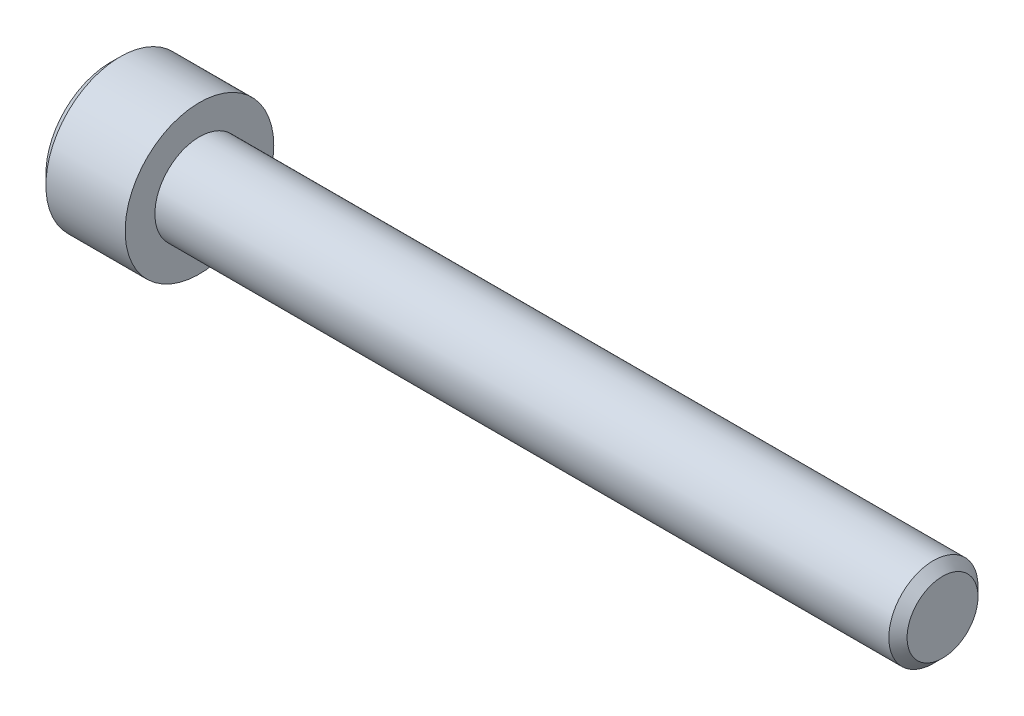
ISO-10303-21;
HEADER;
FILE_DESCRIPTION(('STEP AP214'),'2;1');
FILE_NAME('part.step','',(''),(''),'','','');
FILE_SCHEMA(('AUTOMOTIVE_DESIGN { 1 0 10303 214 1 1 1 1 }'));
ENDSEC;
DATA;
#1=APPLICATION_CONTEXT('core data for automotive mechanical design processes');
#2=APPLICATION_PROTOCOL_DEFINITION('international standard','automotive_design',2000,#1);
#3=PRODUCT_CONTEXT('',#1,'mechanical');
#4=PRODUCT('Part','Part','',(#3));
#5=PRODUCT_RELATED_PRODUCT_CATEGORY('part','',(#4));
#6=PRODUCT_DEFINITION_FORMATION('','',#4);
#7=PRODUCT_DEFINITION_CONTEXT('part definition',#1,'design');
#8=PRODUCT_DEFINITION('design','',#6,#7);
#9=PRODUCT_DEFINITION_SHAPE('','',#8);
#10=(LENGTH_UNIT() NAMED_UNIT(*) SI_UNIT(.MILLI.,.METRE.));
#11=(NAMED_UNIT(*) PLANE_ANGLE_UNIT() SI_UNIT($,.RADIAN.));
#12=(NAMED_UNIT(*) SI_UNIT($,.STERADIAN.) SOLID_ANGLE_UNIT());
#13=UNCERTAINTY_MEASURE_WITH_UNIT(LENGTH_MEASURE(1.E-05),#10,'distance_accuracy_value','');
#14=(GEOMETRIC_REPRESENTATION_CONTEXT(3) GLOBAL_UNCERTAINTY_ASSIGNED_CONTEXT((#13)) GLOBAL_UNIT_ASSIGNED_CONTEXT((#10,
#11,#12)) REPRESENTATION_CONTEXT('',''));
#15=CARTESIAN_POINT('',(0.,0.,0.));
#16=DIRECTION('',(0.,0.,1.));
#17=DIRECTION('',(1.,0.,0.));
#18=AXIS2_PLACEMENT_3D('',#15,#16,#17);
#19=CARTESIAN_POINT('',(-3.,0.,0.));
#20=DIRECTION('',(-1.,0.,0.));
#21=DIRECTION('',(0.,0.,1.));
#22=AXIS2_PLACEMENT_3D('',#19,#20,#21);
#23=CONICAL_SURFACE('',#22,2.5,1.30899693899575);
#24=CARTESIAN_POINT('',(-3.,0.,0.));
#25=DIRECTION('',(1.,0.,0.));
#26=DIRECTION('',(0.,0.,-1.));
#27=AXIS2_PLACEMENT_3D('',#24,#25,#26);
#28=CIRCLE('',#27,2.5);
#29=CARTESIAN_POINT('',(-3.,2.1650635094611,-1.25));
#30=VERTEX_POINT('',#29);
#31=CARTESIAN_POINT('',(-3.,2.1650635094611,1.25));
#32=VERTEX_POINT('',#31);
#33=EDGE_CURVE('E92',#30,#32,#28,.T.);
#34=ORIENTED_EDGE('',*,*,#33,.F.);
#35=CARTESIAN_POINT('',(-3.,0.,0.));
#36=DIRECTION('',(1.,0.,0.));
#37=DIRECTION('',(0.,0.,-1.));
#38=AXIS2_PLACEMENT_3D('',#35,#36,#37);
#39=CIRCLE('',#38,2.5);
#40=CARTESIAN_POINT('',(-3.,0.,-2.5));
#41=VERTEX_POINT('',#40);
#42=EDGE_CURVE('E95',#41,#30,#39,.T.);
#43=ORIENTED_EDGE('',*,*,#42,.F.);
#44=CARTESIAN_POINT('',(-3.,0.,0.));
#45=DIRECTION('',(1.,0.,0.));
#46=DIRECTION('',(0.,0.,-1.));
#47=AXIS2_PLACEMENT_3D('',#44,#45,#46);
#48=CIRCLE('',#47,2.5);
#49=CARTESIAN_POINT('',(-3.,-2.1650635094611,-1.25));
#50=VERTEX_POINT('',#49);
#51=EDGE_CURVE('E10',#50,#41,#48,.T.);
#52=ORIENTED_EDGE('',*,*,#51,.F.);
#53=CARTESIAN_POINT('',(-3.,0.,0.));
#54=DIRECTION('',(1.,0.,0.));
#55=DIRECTION('',(0.,0.,-1.));
#56=AXIS2_PLACEMENT_3D('',#53,#54,#55);
#57=CIRCLE('',#56,2.5);
#58=CARTESIAN_POINT('',(-3.,-2.1650635094611,1.25));
#59=VERTEX_POINT('',#58);
#60=EDGE_CURVE('E25',#59,#50,#57,.T.);
#61=ORIENTED_EDGE('',*,*,#60,.F.);
#62=CARTESIAN_POINT('',(-3.,0.,0.));
#63=DIRECTION('',(1.,0.,0.));
#64=DIRECTION('',(0.,0.,-1.));
#65=AXIS2_PLACEMENT_3D('',#62,#63,#64);
#66=CIRCLE('',#65,2.5);
#67=CARTESIAN_POINT('',(-3.,0.,2.5));
#68=VERTEX_POINT('',#67);
#69=EDGE_CURVE('E141',#68,#59,#66,.T.);
#70=ORIENTED_EDGE('',*,*,#69,.F.);
#71=CARTESIAN_POINT('',(-3.,0.,0.));
#72=DIRECTION('',(1.,0.,0.));
#73=DIRECTION('',(0.,0.,-1.));
#74=AXIS2_PLACEMENT_3D('',#71,#72,#73);
#75=CIRCLE('',#74,2.5);
#76=EDGE_CURVE('E38',#32,#68,#75,.T.);
#77=ORIENTED_EDGE('',*,*,#76,.F.);
#78=EDGE_LOOP('',(#34,#43,#52,#61,#70,#77));
#79=FACE_BOUND('',#78,.T.);
#80=CARTESIAN_POINT('',(-2.33012701892219,0.,0.));
#81=VERTEX_POINT('',#80);
#82=VERTEX_LOOP('',#81);
#83=FACE_BOUND('',#82,.T.);
#84=ADVANCED_FACE('F16',(#79,#83),#23,.F.);
#85=CARTESIAN_POINT('',(-3.,0.,0.));
#86=DIRECTION('',(1.,0.,0.));
#87=DIRECTION('',(0.,1.,0.));
#88=AXIS2_PLACEMENT_3D('',#85,#86,#87);
#89=PLANE('',#88);
#90=ORIENTED_EDGE('',*,*,#51,.T.);
#91=DIRECTION('',(0.,1.,0.));
#92=VECTOR('',#91,1.);
#93=CARTESIAN_POINT('',(-3.,-1.44337567297406,-2.5));
#94=LINE('',#93,#92);
#95=CARTESIAN_POINT('',(-3.,-1.44337567297406,-2.5));
#96=VERTEX_POINT('',#95);
#97=EDGE_CURVE('E161',#96,#41,#94,.T.);
#98=ORIENTED_EDGE('',*,*,#97,.F.);
#99=DIRECTION('',(0.,0.5,-0.866025403784439));
#100=VECTOR('',#99,1.);
#101=CARTESIAN_POINT('',(-3.,-2.88675134594813,0.));
#102=LINE('',#101,#100);
#103=EDGE_CURVE('E159',#50,#96,#102,.T.);
#104=ORIENTED_EDGE('',*,*,#103,.F.);
#105=EDGE_LOOP('',(#90,#98,#104));
#106=FACE_BOUND('',#105,.T.);
#107=ADVANCED_FACE('F160',(#106),#89,.F.);
#108=CARTESIAN_POINT('',(-3.,0.,0.));
#109=DIRECTION('',(1.,0.,0.));
#110=DIRECTION('',(0.,1.,0.));
#111=AXIS2_PLACEMENT_3D('',#108,#109,#110);
#112=PLANE('',#111);
#113=ORIENTED_EDGE('',*,*,#60,.T.);
#114=DIRECTION('',(0.,0.5,-0.866025403784439));
#115=VECTOR('',#114,1.);
#116=CARTESIAN_POINT('',(-3.,-2.88675134594813,0.));
#117=LINE('',#116,#115);
#118=CARTESIAN_POINT('',(-3.,-2.88675134594813,0.));
#119=VERTEX_POINT('',#118);
#120=EDGE_CURVE('E152',#119,#50,#117,.T.);
#121=ORIENTED_EDGE('',*,*,#120,.F.);
#122=DIRECTION('',(0.,-0.5,-0.866025403784439));
#123=VECTOR('',#122,1.);
#124=CARTESIAN_POINT('',(-3.,-1.44337567297406,2.5));
#125=LINE('',#124,#123);
#126=EDGE_CURVE('E155',#59,#119,#125,.T.);
#127=ORIENTED_EDGE('',*,*,#126,.F.);
#128=EDGE_LOOP('',(#113,#121,#127));
#129=FACE_BOUND('',#128,.T.);
#130=ADVANCED_FACE('F150',(#129),#112,.F.);
#131=CARTESIAN_POINT('',(-3.,0.,0.));
#132=DIRECTION('',(1.,0.,0.));
#133=DIRECTION('',(0.,1.,0.));
#134=AXIS2_PLACEMENT_3D('',#131,#132,#133);
#135=PLANE('',#134);
#136=ORIENTED_EDGE('',*,*,#69,.T.);
#137=DIRECTION('',(0.,-0.5,-0.866025403784439));
#138=VECTOR('',#137,1.);
#139=CARTESIAN_POINT('',(-3.,-1.44337567297406,2.5));
#140=LINE('',#139,#138);
#141=CARTESIAN_POINT('',(-3.,-1.44337567297406,2.5));
#142=VERTEX_POINT('',#141);
#143=EDGE_CURVE('E228',#142,#59,#140,.T.);
#144=ORIENTED_EDGE('',*,*,#143,.F.);
#145=DIRECTION('',(0.,-1.,0.));
#146=VECTOR('',#145,1.);
#147=CARTESIAN_POINT('',(-3.,1.44337567297406,2.5));
#148=LINE('',#147,#146);
#149=EDGE_CURVE('E232',#68,#142,#148,.T.);
#150=ORIENTED_EDGE('',*,*,#149,.F.);
#151=EDGE_LOOP('',(#136,#144,#150));
#152=FACE_BOUND('',#151,.T.);
#153=ADVANCED_FACE('F230',(#152),#135,.F.);
#154=CARTESIAN_POINT('',(-3.,0.,0.));
#155=DIRECTION('',(1.,0.,0.));
#156=DIRECTION('',(0.,1.,0.));
#157=AXIS2_PLACEMENT_3D('',#154,#155,#156);
#158=PLANE('',#157);
#159=ORIENTED_EDGE('',*,*,#76,.T.);
#160=DIRECTION('',(0.,-1.,0.));
#161=VECTOR('',#160,1.);
#162=CARTESIAN_POINT('',(-3.,1.44337567297406,2.5));
#163=LINE('',#162,#161);
#164=CARTESIAN_POINT('',(-3.,1.44337567297406,2.5));
#165=VERTEX_POINT('',#164);
#166=EDGE_CURVE('E250',#165,#68,#163,.T.);
#167=ORIENTED_EDGE('',*,*,#166,.F.);
#168=DIRECTION('',(0.,-0.5,0.866025403784439));
#169=VECTOR('',#168,1.);
#170=CARTESIAN_POINT('',(-3.,2.88675134594813,0.));
#171=LINE('',#170,#169);
#172=EDGE_CURVE('E111',#32,#165,#171,.T.);
#173=ORIENTED_EDGE('',*,*,#172,.F.);
#174=EDGE_LOOP('',(#159,#167,#173));
#175=FACE_BOUND('',#174,.T.);
#176=ADVANCED_FACE('F308',(#175),#158,.F.);
#177=CARTESIAN_POINT('',(-3.,0.,0.));
#178=DIRECTION('',(1.,0.,0.));
#179=DIRECTION('',(0.,1.,0.));
#180=AXIS2_PLACEMENT_3D('',#177,#178,#179);
#181=PLANE('',#180);
#182=DIRECTION('',(0.,0.5,0.866025403784439));
#183=VECTOR('',#182,1.);
#184=CARTESIAN_POINT('',(-3.,1.44337567297406,-2.5));
#185=LINE('',#184,#183);
#186=CARTESIAN_POINT('',(-3.,2.88675134594813,0.));
#187=VERTEX_POINT('',#186);
#188=EDGE_CURVE('E114',#30,#187,#185,.T.);
#189=ORIENTED_EDGE('',*,*,#188,.F.);
#190=ORIENTED_EDGE('',*,*,#33,.T.);
#191=DIRECTION('',(0.,-0.5,0.866025403784439));
#192=VECTOR('',#191,1.);
#193=CARTESIAN_POINT('',(-3.,2.88675134594813,0.));
#194=LINE('',#193,#192);
#195=EDGE_CURVE('E117',#187,#32,#194,.T.);
#196=ORIENTED_EDGE('',*,*,#195,.F.);
#197=EDGE_LOOP('',(#189,#190,#196));
#198=FACE_BOUND('',#197,.T.);
#199=ADVANCED_FACE('F115',(#198),#181,.F.);
#200=CARTESIAN_POINT('',(-3.,0.,0.));
#201=DIRECTION('',(1.,0.,0.));
#202=DIRECTION('',(0.,1.,0.));
#203=AXIS2_PLACEMENT_3D('',#200,#201,#202);
#204=PLANE('',#203);
#205=ORIENTED_EDGE('',*,*,#42,.T.);
#206=DIRECTION('',(0.,0.5,0.866025403784439));
#207=VECTOR('',#206,1.);
#208=CARTESIAN_POINT('',(-3.,1.44337567297406,-2.5));
#209=LINE('',#208,#207);
#210=CARTESIAN_POINT('',(-3.,1.44337567297406,-2.5));
#211=VERTEX_POINT('',#210);
#212=EDGE_CURVE('E105',#211,#30,#209,.T.);
#213=ORIENTED_EDGE('',*,*,#212,.F.);
#214=DIRECTION('',(0.,1.,0.));
#215=VECTOR('',#214,1.);
#216=CARTESIAN_POINT('',(-3.,-1.44337567297406,-2.5));
#217=LINE('',#216,#215);
#218=EDGE_CURVE('E108',#41,#211,#217,.T.);
#219=ORIENTED_EDGE('',*,*,#218,.F.);
#220=EDGE_LOOP('',(#205,#213,#219));
#221=FACE_BOUND('',#220,.T.);
#222=ADVANCED_FACE('F103',(#221),#204,.F.);
#223=CARTESIAN_POINT('',(-3.,2.88675134594813,0.));
#224=DIRECTION('',(0.,-0.866025403784439,-0.5));
#225=DIRECTION('',(0.,0.5,-0.866025403784439));
#226=AXIS2_PLACEMENT_3D('',#223,#224,#225);
#227=PLANE('',#226);
#228=DIRECTION('',(0.,-0.5,0.866025403784439));
#229=VECTOR('',#228,1.);
#230=CARTESIAN_POINT('',(-6.,2.88675134594813,0.));
#231=LINE('',#230,#229);
#232=CARTESIAN_POINT('',(-6.,2.88675134594813,0.));
#233=VERTEX_POINT('',#232);
#234=CARTESIAN_POINT('',(-6.,1.44337567297406,2.5));
#235=VERTEX_POINT('',#234);
#236=EDGE_CURVE('E275',#233,#235,#231,.T.);
#237=ORIENTED_EDGE('',*,*,#236,.F.);
#238=DIRECTION('',(-1.,0.,0.));
#239=VECTOR('',#238,1.);
#240=CARTESIAN_POINT('',(-3.,2.88675134594813,0.));
#241=LINE('',#240,#239);
#242=EDGE_CURVE('E122',#187,#233,#241,.T.);
#243=ORIENTED_EDGE('',*,*,#242,.F.);
#244=ORIENTED_EDGE('',*,*,#195,.T.);
#245=ORIENTED_EDGE('',*,*,#172,.T.);
#246=DIRECTION('',(-1.,0.,0.));
#247=VECTOR('',#246,1.);
#248=CARTESIAN_POINT('',(-3.,1.44337567297406,2.5));
#249=LINE('',#248,#247);
#250=EDGE_CURVE('E256',#165,#235,#249,.T.);
#251=ORIENTED_EDGE('',*,*,#250,.T.);
#252=EDGE_LOOP('',(#237,#243,#244,#245,#251));
#253=FACE_BOUND('',#252,.T.);
#254=ADVANCED_FACE('F306',(#253),#227,.T.);
#255=CARTESIAN_POINT('',(-3.,1.44337567297406,-2.5));
#256=DIRECTION('',(0.,-0.866025403784439,0.5));
#257=DIRECTION('',(-1.,0.,0.));
#258=AXIS2_PLACEMENT_3D('',#255,#256,#257);
#259=PLANE('',#258);
#260=DIRECTION('',(0.,0.5,0.866025403784439));
#261=VECTOR('',#260,1.);
#262=CARTESIAN_POINT('',(-6.,1.44337567297406,-2.5));
#263=LINE('',#262,#261);
#264=CARTESIAN_POINT('',(-6.,1.44337567297406,-2.5));
#265=VERTEX_POINT('',#264);
#266=EDGE_CURVE('E299',#265,#233,#263,.T.);
#267=ORIENTED_EDGE('',*,*,#266,.F.);
#268=DIRECTION('',(-1.,0.,0.));
#269=VECTOR('',#268,1.);
#270=CARTESIAN_POINT('',(-3.,1.44337567297406,-2.5));
#271=LINE('',#270,#269);
#272=EDGE_CURVE('E127',#211,#265,#271,.T.);
#273=ORIENTED_EDGE('',*,*,#272,.F.);
#274=ORIENTED_EDGE('',*,*,#212,.T.);
#275=ORIENTED_EDGE('',*,*,#188,.T.);
#276=ORIENTED_EDGE('',*,*,#242,.T.);
#277=EDGE_LOOP('',(#267,#273,#274,#275,#276));
#278=FACE_BOUND('',#277,.T.);
#279=ADVANCED_FACE('F125',(#278),#259,.T.);
#280=CARTESIAN_POINT('',(-3.,-1.44337567297406,-2.5));
#281=DIRECTION('',(0.,0.,1.));
#282=DIRECTION('',(1.,0.,0.));
#283=AXIS2_PLACEMENT_3D('',#280,#281,#282);
#284=PLANE('',#283);
#285=DIRECTION('',(0.,1.,0.));
#286=VECTOR('',#285,1.);
#287=CARTESIAN_POINT('',(-6.,-1.44337567297406,-2.5));
#288=LINE('',#287,#286);
#289=CARTESIAN_POINT('',(-6.,-1.44337567297406,-2.5));
#290=VERTEX_POINT('',#289);
#291=EDGE_CURVE('E192',#290,#265,#288,.T.);
#292=ORIENTED_EDGE('',*,*,#291,.F.);
#293=DIRECTION('',(-1.,0.,0.));
#294=VECTOR('',#293,1.);
#295=CARTESIAN_POINT('',(-3.,-1.44337567297406,-2.5));
#296=LINE('',#295,#294);
#297=EDGE_CURVE('E166',#96,#290,#296,.T.);
#298=ORIENTED_EDGE('',*,*,#297,.F.);
#299=ORIENTED_EDGE('',*,*,#97,.T.);
#300=ORIENTED_EDGE('',*,*,#218,.T.);
#301=ORIENTED_EDGE('',*,*,#272,.T.);
#302=EDGE_LOOP('',(#292,#298,#299,#300,#301));
#303=FACE_BOUND('',#302,.T.);
#304=ADVANCED_FACE('F188',(#303),#284,.T.);
#305=CARTESIAN_POINT('',(-3.,-2.88675134594813,0.));
#306=DIRECTION('',(0.,0.866025403784439,0.5));
#307=DIRECTION('',(1.,0.,0.));
#308=AXIS2_PLACEMENT_3D('',#305,#306,#307);
#309=PLANE('',#308);
#310=DIRECTION('',(0.,0.5,-0.866025403784439));
#311=VECTOR('',#310,1.);
#312=CARTESIAN_POINT('',(-6.,-2.88675134594813,0.));
#313=LINE('',#312,#311);
#314=CARTESIAN_POINT('',(-6.,-2.88675134594813,0.));
#315=VERTEX_POINT('',#314);
#316=EDGE_CURVE('E195',#315,#290,#313,.T.);
#317=ORIENTED_EDGE('',*,*,#316,.F.);
#318=DIRECTION('',(-1.,0.,0.));
#319=VECTOR('',#318,1.);
#320=CARTESIAN_POINT('',(-3.,-2.88675134594813,0.));
#321=LINE('',#320,#319);
#322=EDGE_CURVE('E171',#119,#315,#321,.T.);
#323=ORIENTED_EDGE('',*,*,#322,.F.);
#324=ORIENTED_EDGE('',*,*,#120,.T.);
#325=ORIENTED_EDGE('',*,*,#103,.T.);
#326=ORIENTED_EDGE('',*,*,#297,.T.);
#327=EDGE_LOOP('',(#317,#323,#324,#325,#326));
#328=FACE_BOUND('',#327,.T.);
#329=ADVANCED_FACE('F169',(#328),#309,.T.);
#330=CARTESIAN_POINT('',(-3.,-1.44337567297406,2.5));
#331=DIRECTION('',(0.,0.866025403784439,-0.5));
#332=DIRECTION('',(-1.,0.,0.));
#333=AXIS2_PLACEMENT_3D('',#330,#331,#332);
#334=PLANE('',#333);
#335=DIRECTION('',(0.,-0.5,-0.866025403784439));
#336=VECTOR('',#335,1.);
#337=CARTESIAN_POINT('',(-6.,-1.44337567297406,2.5));
#338=LINE('',#337,#336);
#339=CARTESIAN_POINT('',(-6.,-1.44337567297406,2.5));
#340=VERTEX_POINT('',#339);
#341=EDGE_CURVE('E241',#340,#315,#338,.T.);
#342=ORIENTED_EDGE('',*,*,#341,.F.);
#343=DIRECTION('',(-1.,0.,0.));
#344=VECTOR('',#343,1.);
#345=CARTESIAN_POINT('',(-3.,-1.44337567297406,2.5));
#346=LINE('',#345,#344);
#347=EDGE_CURVE('E236',#142,#340,#346,.T.);
#348=ORIENTED_EDGE('',*,*,#347,.F.);
#349=ORIENTED_EDGE('',*,*,#143,.T.);
#350=ORIENTED_EDGE('',*,*,#126,.T.);
#351=ORIENTED_EDGE('',*,*,#322,.T.);
#352=EDGE_LOOP('',(#342,#348,#349,#350,#351));
#353=FACE_BOUND('',#352,.T.);
#354=ADVANCED_FACE('F239',(#353),#334,.T.);
#355=CARTESIAN_POINT('',(-3.,1.44337567297406,2.5));
#356=DIRECTION('',(0.,0.,-1.));
#357=DIRECTION('',(0.,-1.,0.));
#358=AXIS2_PLACEMENT_3D('',#355,#356,#357);
#359=PLANE('',#358);
#360=DIRECTION('',(0.,-1.,0.));
#361=VECTOR('',#360,1.);
#362=CARTESIAN_POINT('',(-6.,1.44337567297406,2.5));
#363=LINE('',#362,#361);
#364=EDGE_CURVE('E266',#235,#340,#363,.T.);
#365=ORIENTED_EDGE('',*,*,#364,.F.);
#366=ORIENTED_EDGE('',*,*,#250,.F.);
#367=ORIENTED_EDGE('',*,*,#166,.T.);
#368=ORIENTED_EDGE('',*,*,#149,.T.);
#369=ORIENTED_EDGE('',*,*,#347,.T.);
#370=EDGE_LOOP('',(#365,#366,#367,#368,#369));
#371=FACE_BOUND('',#370,.T.);
#372=ADVANCED_FACE('F247',(#371),#359,.T.);
#373=CARTESIAN_POINT('',(50.,2.3865,0.));
#374=DIRECTION('',(-1.,0.,0.));
#375=DIRECTION('',(0.,0.,1.));
#376=AXIS2_PLACEMENT_3D('',#373,#374,#375);
#377=PLANE('',#376);
#378=CARTESIAN_POINT('',(50.,0.,0.));
#379=DIRECTION('',(1.,0.,0.));
#380=DIRECTION('',(0.,0.,-1.));
#381=AXIS2_PLACEMENT_3D('',#378,#379,#380);
#382=CIRCLE('',#381,2.3865);
#383=CARTESIAN_POINT('',(50.,0.,-2.3865));
#384=VERTEX_POINT('',#383);
#385=EDGE_CURVE('E280',#384,#384,#382,.T.);
#386=ORIENTED_EDGE('',*,*,#385,.T.);
#387=EDGE_LOOP('',(#386));
#388=FACE_BOUND('',#387,.T.);
#389=ADVANCED_FACE('F411',(#388),#377,.F.);
#390=CARTESIAN_POINT('',(49.3865,0.,0.));
#391=DIRECTION('',(-1.,0.,0.));
#392=DIRECTION('',(0.,0.,1.));
#393=AXIS2_PLACEMENT_3D('',#390,#391,#392);
#394=CONICAL_SURFACE('',#393,3.,0.785398163397441);
#395=CARTESIAN_POINT('',(49.3865,0.,0.));
#396=DIRECTION('',(1.,0.,0.));
#397=DIRECTION('',(0.,0.,-1.));
#398=AXIS2_PLACEMENT_3D('',#395,#396,#397);
#399=CIRCLE('',#398,3.);
#400=CARTESIAN_POINT('',(49.3865,0.,-3.));
#401=VERTEX_POINT('',#400);
#402=EDGE_CURVE('E282',#401,#401,#399,.T.);
#403=ORIENTED_EDGE('',*,*,#402,.T.);
#404=EDGE_LOOP('',(#403));
#405=FACE_BOUND('',#404,.T.);
#406=ORIENTED_EDGE('',*,*,#385,.F.);
#407=EDGE_LOOP('',(#406));
#408=FACE_BOUND('',#407,.T.);
#409=ADVANCED_FACE('F420',(#405,#408),#394,.T.);
#410=CARTESIAN_POINT('',(50.,0.,0.));
#411=DIRECTION('',(1.,0.,0.));
#412=DIRECTION('',(0.,0.,-1.));
#413=AXIS2_PLACEMENT_3D('',#410,#411,#412);
#414=CYLINDRICAL_SURFACE('',#413,3.);
#415=CARTESIAN_POINT('',(0.,0.,0.));
#416=DIRECTION('',(1.,0.,0.));
#417=DIRECTION('',(0.,0.,-1.));
#418=AXIS2_PLACEMENT_3D('',#415,#416,#417);
#419=CIRCLE('',#418,3.);
#420=CARTESIAN_POINT('',(0.,0.,-3.));
#421=VERTEX_POINT('',#420);
#422=EDGE_CURVE('E279',#421,#421,#419,.T.);
#423=ORIENTED_EDGE('',*,*,#422,.T.);
#424=EDGE_LOOP('',(#423));
#425=FACE_BOUND('',#424,.T.);
#426=ORIENTED_EDGE('',*,*,#402,.F.);
#427=EDGE_LOOP('',(#426));
#428=FACE_BOUND('',#427,.T.);
#429=ADVANCED_FACE('F428',(#425,#428),#414,.T.);
#430=CARTESIAN_POINT('',(0.,5.,0.));
#431=DIRECTION('',(-1.,0.,0.));
#432=DIRECTION('',(0.,0.,1.));
#433=AXIS2_PLACEMENT_3D('',#430,#431,#432);
#434=PLANE('',#433);
#435=CARTESIAN_POINT('',(0.,0.,0.));
#436=DIRECTION('',(1.,0.,0.));
#437=DIRECTION('',(0.,0.,-1.));
#438=AXIS2_PLACEMENT_3D('',#435,#436,#437);
#439=CIRCLE('',#438,5.);
#440=CARTESIAN_POINT('',(0.,0.,-5.));
#441=VERTEX_POINT('',#440);
#442=EDGE_CURVE('E272',#441,#441,#439,.T.);
#443=ORIENTED_EDGE('',*,*,#442,.T.);
#444=EDGE_LOOP('',(#443));
#445=FACE_BOUND('',#444,.T.);
#446=ORIENTED_EDGE('',*,*,#422,.F.);
#447=EDGE_LOOP('',(#446));
#448=FACE_BOUND('',#447,.T.);
#449=ADVANCED_FACE('F437',(#445,#448),#434,.F.);
#450=CARTESIAN_POINT('',(50.,0.,0.));
#451=DIRECTION('',(1.,0.,0.));
#452=DIRECTION('',(0.,0.,-1.));
#453=AXIS2_PLACEMENT_3D('',#450,#451,#452);
#454=CYLINDRICAL_SURFACE('',#453,5.);
#455=CARTESIAN_POINT('',(-5.33333333333334,0.,0.));
#456=DIRECTION('',(1.,0.,0.));
#457=DIRECTION('',(0.,0.,-1.));
#458=AXIS2_PLACEMENT_3D('',#455,#456,#457);
#459=CIRCLE('',#458,5.);
#460=CARTESIAN_POINT('',(-5.33333333333334,0.,-5.));
#461=VERTEX_POINT('',#460);
#462=EDGE_CURVE('E268',#461,#461,#459,.T.);
#463=ORIENTED_EDGE('',*,*,#462,.T.);
#464=EDGE_LOOP('',(#463));
#465=FACE_BOUND('',#464,.T.);
#466=ORIENTED_EDGE('',*,*,#442,.F.);
#467=EDGE_LOOP('',(#466));
#468=FACE_BOUND('',#467,.T.);
#469=ADVANCED_FACE('F446',(#465,#468),#454,.T.);
#470=CARTESIAN_POINT('',(-6.,0.,0.));
#471=DIRECTION('',(1.,0.,0.));
#472=DIRECTION('',(0.,0.,-1.));
#473=AXIS2_PLACEMENT_3D('',#470,#471,#472);
#474=CONICAL_SURFACE('',#473,4.33333333333333,0.785398163397452);
#475=CARTESIAN_POINT('',(-6.,0.,0.));
#476=DIRECTION('',(1.,0.,0.));
#477=DIRECTION('',(0.,0.,-1.));
#478=AXIS2_PLACEMENT_3D('',#475,#476,#477);
#479=CIRCLE('',#478,4.33333333333333);
#480=CARTESIAN_POINT('',(-6.,0.,-4.33333333333333));
#481=VERTEX_POINT('',#480);
#482=EDGE_CURVE('E479',#481,#481,#479,.T.);
#483=ORIENTED_EDGE('',*,*,#482,.T.);
#484=EDGE_LOOP('',(#483));
#485=FACE_BOUND('',#484,.T.);
#486=ORIENTED_EDGE('',*,*,#462,.F.);
#487=EDGE_LOOP('',(#486));
#488=FACE_BOUND('',#487,.T.);
#489=ADVANCED_FACE('F455',(#485,#488),#474,.T.);
#490=CARTESIAN_POINT('',(-6.,0.,0.));
#491=DIRECTION('',(1.,0.,0.));
#492=DIRECTION('',(0.,1.,0.));
#493=AXIS2_PLACEMENT_3D('',#490,#491,#492);
#494=PLANE('',#493);
#495=ORIENTED_EDGE('',*,*,#316,.T.);
#496=ORIENTED_EDGE('',*,*,#291,.T.);
#497=ORIENTED_EDGE('',*,*,#266,.T.);
#498=ORIENTED_EDGE('',*,*,#236,.T.);
#499=ORIENTED_EDGE('',*,*,#364,.T.);
#500=ORIENTED_EDGE('',*,*,#341,.T.);
#501=EDGE_LOOP('',(#495,#496,#497,#498,#499,#500));
#502=FACE_BOUND('',#501,.T.);
#503=ORIENTED_EDGE('',*,*,#482,.F.);
#504=EDGE_LOOP('',(#503));
#505=FACE_BOUND('',#504,.T.);
#506=ADVANCED_FACE('F263',(#502,#505),#494,.F.);
#507=CLOSED_SHELL('',(#84,#107,#130,#153,#176,#199,#222,#254,#279,#304,#329,#354,#372,#389,#409,
#429,#449,#469,#489,#506));
#508=MANIFOLD_SOLID_BREP('B1',#507);
#509=ADVANCED_BREP_SHAPE_REPRESENTATION('',(#18,#508),#14);
#510=SHAPE_DEFINITION_REPRESENTATION(#9,#509);
ENDSEC;
END-ISO-10303-21;
